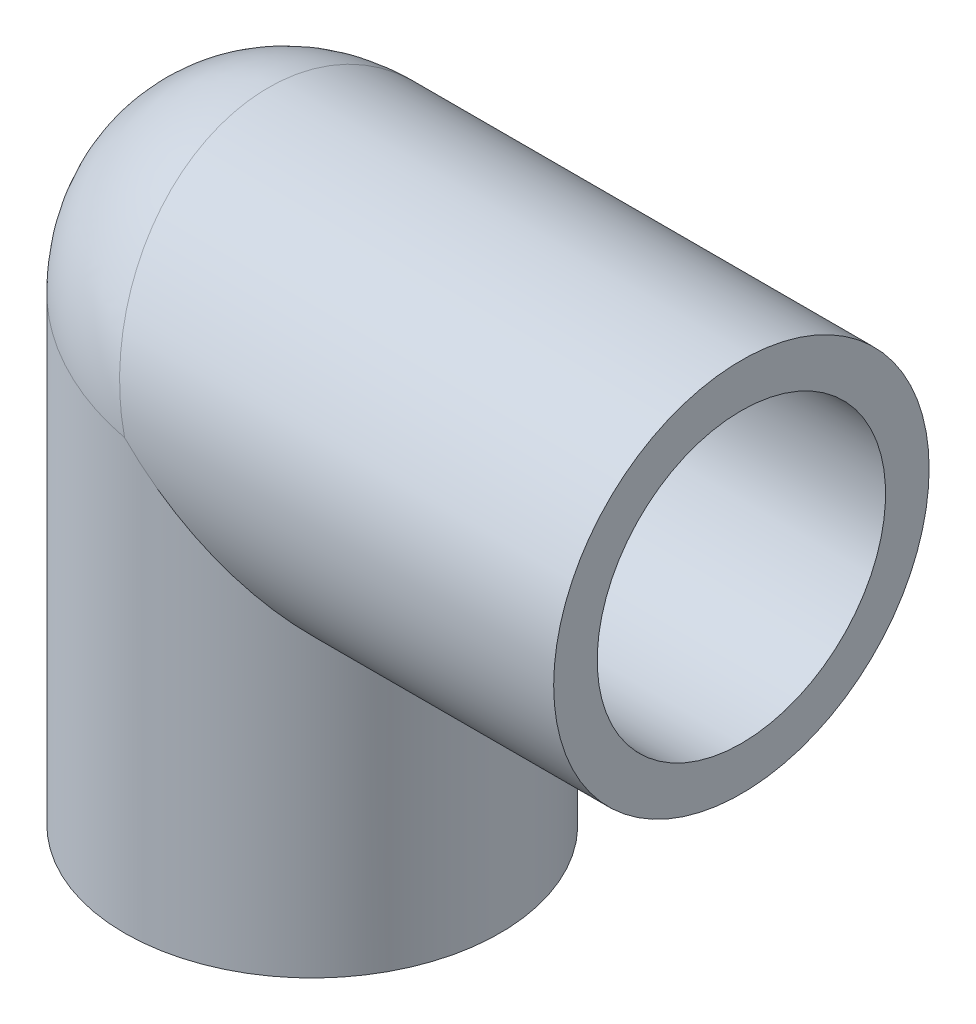
ISO-10303-21;
HEADER;
FILE_DESCRIPTION(('STEP AP214'),'2;1');
FILE_NAME('part.step','',(''),(''),'','','');
FILE_SCHEMA(('AUTOMOTIVE_DESIGN { 1 0 10303 214 1 1 1 1 }'));
ENDSEC;
DATA;
#1=APPLICATION_CONTEXT('core data for automotive mechanical design processes');
#2=APPLICATION_PROTOCOL_DEFINITION('international standard','automotive_design',2000,#1);
#3=PRODUCT_CONTEXT('',#1,'mechanical');
#4=PRODUCT('Part','Part','',(#3));
#5=PRODUCT_RELATED_PRODUCT_CATEGORY('part','',(#4));
#6=PRODUCT_DEFINITION_FORMATION('','',#4);
#7=PRODUCT_DEFINITION_CONTEXT('part definition',#1,'design');
#8=PRODUCT_DEFINITION('design','',#6,#7);
#9=PRODUCT_DEFINITION_SHAPE('','',#8);
#10=(LENGTH_UNIT() NAMED_UNIT(*) SI_UNIT(.MILLI.,.METRE.));
#11=(NAMED_UNIT(*) PLANE_ANGLE_UNIT() SI_UNIT($,.RADIAN.));
#12=(NAMED_UNIT(*) SI_UNIT($,.STERADIAN.) SOLID_ANGLE_UNIT());
#13=UNCERTAINTY_MEASURE_WITH_UNIT(LENGTH_MEASURE(1.E-05),#10,'distance_accuracy_value','');
#14=(GEOMETRIC_REPRESENTATION_CONTEXT(3) GLOBAL_UNCERTAINTY_ASSIGNED_CONTEXT((#13)) GLOBAL_UNIT_ASSIGNED_CONTEXT((#10,
#11,#12)) REPRESENTATION_CONTEXT('',''));
#15=CARTESIAN_POINT('',(0.,0.,0.));
#16=DIRECTION('',(0.,0.,1.));
#17=DIRECTION('',(1.,0.,0.));
#18=AXIS2_PLACEMENT_3D('',#15,#16,#17);
#19=CARTESIAN_POINT('',(0.,-12.7,0.));
#20=DIRECTION('',(0.,-1.,0.));
#21=DIRECTION('',(0.,0.,-1.));
#22=AXIS2_PLACEMENT_3D('',#19,#20,#21);
#23=PLANE('',#22);
#24=CARTESIAN_POINT('',(0.,-12.7,0.));
#25=DIRECTION('',(0.,-1.,0.));
#26=DIRECTION('',(0.,0.,-1.));
#27=AXIS2_PLACEMENT_3D('',#24,#25,#26);
#28=CIRCLE('',#27,10.668);
#29=CARTESIAN_POINT('',(0.,-12.7,-10.668));
#30=VERTEX_POINT('',#29);
#31=EDGE_CURVE('E76',#30,#30,#28,.T.);
#32=ORIENTED_EDGE('',*,*,#31,.T.);
#33=EDGE_LOOP('',(#32));
#34=FACE_BOUND('',#33,.T.);
#35=CARTESIAN_POINT('',(0.,-12.7,0.));
#36=DIRECTION('',(0.,1.,0.));
#37=DIRECTION('',(0.,0.,1.));
#38=AXIS2_PLACEMENT_3D('',#35,#36,#37);
#39=CIRCLE('',#38,6.9342);
#40=CARTESIAN_POINT('',(-6.9342,-12.7,0.));
#41=VERTEX_POINT('',#40);
#42=EDGE_CURVE('E93',#41,#41,#39,.T.);
#43=ORIENTED_EDGE('',*,*,#42,.T.);
#44=EDGE_LOOP('',(#43));
#45=FACE_BOUND('',#44,.T.);
#46=ADVANCED_FACE('F43',(#34,#45),#23,.T.);
#47=CARTESIAN_POINT('',(12.7,0.,0.));
#48=DIRECTION('',(1.,0.,0.));
#49=DIRECTION('',(0.,1.,0.));
#50=AXIS2_PLACEMENT_3D('',#47,#48,#49);
#51=PLANE('',#50);
#52=CARTESIAN_POINT('',(12.7,0.,0.));
#53=DIRECTION('',(1.,0.,0.));
#54=DIRECTION('',(0.,1.,0.));
#55=AXIS2_PLACEMENT_3D('',#52,#53,#54);
#56=CIRCLE('',#55,10.668);
#57=CARTESIAN_POINT('',(12.7,10.668,0.));
#58=VERTEX_POINT('',#57);
#59=EDGE_CURVE('E82',#58,#58,#56,.T.);
#60=ORIENTED_EDGE('',*,*,#59,.T.);
#61=EDGE_LOOP('',(#60));
#62=FACE_BOUND('',#61,.T.);
#63=CARTESIAN_POINT('',(12.7,0.,0.));
#64=DIRECTION('',(1.,0.,0.));
#65=DIRECTION('',(0.,0.,1.));
#66=AXIS2_PLACEMENT_3D('',#63,#64,#65);
#67=CIRCLE('',#66,6.9342);
#68=CARTESIAN_POINT('',(12.7,6.93419999999999,0.));
#69=VERTEX_POINT('',#68);
#70=EDGE_CURVE('E88',#69,#69,#67,.T.);
#71=ORIENTED_EDGE('',*,*,#70,.F.);
#72=EDGE_LOOP('',(#71));
#73=FACE_BOUND('',#72,.T.);
#74=ADVANCED_FACE('F112',(#62,#73),#51,.T.);
#75=CARTESIAN_POINT('',(0.,0.,-13.890625));
#76=CARTESIAN_POINT('',(0.,0.,-13.890625));
#77=CARTESIAN_POINT('',(0.,0.,-13.890625));
#78=CARTESIAN_POINT('',(-0.326030417014347,0.0756390567307606,-13.8906027574469));
#79=CARTESIAN_POINT('',(-0.200837417123203,0.200837417123202,-13.8905885661179));
#80=CARTESIAN_POINT('',(-0.0756390567307606,0.326030417014347,-13.8906027574469));
#81=CARTESIAN_POINT('',(-0.6520573367005,0.15127730210429,-13.8791450873196));
#82=CARTESIAN_POINT('',(-0.401833804761431,0.401833804761431,-13.8879604827564));
#83=CARTESIAN_POINT('',(-0.15127730210429,0.6520573367005,-13.8791450873196));
#84=CARTESIAN_POINT('',(-1.30330403167624,0.30236653535915,-13.8332061930762));
#85=CARTESIAN_POINT('',(-0.804866601879955,0.804866601879956,-13.8772303622792));
#86=CARTESIAN_POINT('',(-0.30236653535915,1.30330403167624,-13.8332061930762));
#87=CARTESIAN_POINT('',(-1.62852379170069,0.377817519698968,-13.7987245368072));
#88=CARTESIAN_POINT('',(-1.00723840387897,1.00723840387897,-13.8691102658237));
#89=CARTESIAN_POINT('',(-0.377817519698968,1.62852379170069,-13.7987245368072));
#90=CARTESIAN_POINT('',(-2.27790946913727,0.528474996862335,-13.7065046179071));
#91=CARTESIAN_POINT('',(-1.41477886770129,1.41477886770129,-13.847002608813));
#92=CARTESIAN_POINT('',(-0.528474996862335,2.27790946913727,-13.7065046179071));
#93=CARTESIAN_POINT('',(-2.60207255961244,0.603680833836455,-13.648725902029));
#94=CARTESIAN_POINT('',(-1.62029821331791,1.62029821331791,-13.8329669339002));
#95=CARTESIAN_POINT('',(-0.603680833836455,2.60207255961244,-13.648725902029));
#96=CARTESIAN_POINT('',(-3.24781115447715,0.753492187832481,-13.5096376734908));
#97=CARTESIAN_POINT('',(-2.03519864516539,2.03519864516539,-13.7982019625138));
#98=CARTESIAN_POINT('',(-0.753492187832481,3.24781115447715,-13.5096376734908));
#99=CARTESIAN_POINT('',(-3.56938645993629,0.828097658702539,-13.4283263692425));
#100=CARTESIAN_POINT('',(-2.24494413307651,2.24494413307651,-13.7774095882762));
#101=CARTESIAN_POINT('',(-0.828097658702539,3.56938645993629,-13.4283263692425));
#102=CARTESIAN_POINT('',(-4.66065831107523,1.08127272817592,-13.1100510969373));
#103=CARTESIAN_POINT('',(-2.97330543159556,2.97330543159556,-13.6929261775302));
#104=CARTESIAN_POINT('',(-1.08127272817592,4.66065831107523,-13.1100510969373));
#105=CARTESIAN_POINT('',(-5.4227228784835,1.25807170781613,-12.8152974170361));
#106=CARTESIAN_POINT('',(-3.50601760177652,3.50601760177652,-13.6100702976292));
#107=CARTESIAN_POINT('',(-1.25807170781613,5.4227228784835,-12.8152974170361));
#108=CARTESIAN_POINT('',(-6.53838795154788,1.51690600476394,-12.2626064585577));
#109=CARTESIAN_POINT('',(-4.33857925975706,4.33857925975706,-13.4313993181265));
#110=CARTESIAN_POINT('',(-1.51690600476394,6.53838795154788,-12.2626064585577));
#111=CARTESIAN_POINT('',(-6.90606351946638,1.60220673651909,-12.059687126308));
#112=CARTESIAN_POINT('',(-4.62596125358252,4.62596125358252,-13.3615246248215));
#113=CARTESIAN_POINT('',(-1.60220673651909,6.90606351946638,-12.059687126308));
#114=CARTESIAN_POINT('',(-7.62976974409105,1.77010658062858,-11.6153504215895));
#115=CARTESIAN_POINT('',(-5.2179989156884,5.2179989156884,-13.1957575296165));
#116=CARTESIAN_POINT('',(-1.77010658062858,7.62976974409105,-11.6153504215895));
#117=CARTESIAN_POINT('',(-7.98579951227385,1.85270548684549,-11.3739301198837));
#118=CARTESIAN_POINT('',(-5.52360240194462,5.52360240194462,-13.0992580138327));
#119=CARTESIAN_POINT('',(-1.85270548684549,7.98579951227385,-11.3739301198837));
#120=CARTESIAN_POINT('',(-8.71143735468956,2.02105346629019,-10.829704852145));
#121=CARTESIAN_POINT('',(-6.18150635776142,6.18150635776142,-12.8609211236877));
#122=CARTESIAN_POINT('',(-2.02105346629019,8.71143735468956,-10.829704852145));
#123=CARTESIAN_POINT('',(-9.07977726132714,2.10650832463645,-10.5234956939638));
#124=CARTESIAN_POINT('',(-6.5363137067397,6.5363137067397,-12.7151076624425));
#125=CARTESIAN_POINT('',(-2.10650832463645,9.07977726132714,-10.5234956939638));
#126=CARTESIAN_POINT('',(-9.79403741645333,2.2722166806238,-9.86220937286497));
#127=CARTESIAN_POINT('',(-7.27263098475856,7.27263098475856,-12.3635839633349));
#128=CARTESIAN_POINT('',(-2.2722166806238,9.79403741645333,-9.86220937286497));
#129=CARTESIAN_POINT('',(-10.1399556692208,2.35246971525758,-9.50712786864768));
#130=CARTESIAN_POINT('',(-7.65549405557506,7.65549405557506,-12.1561272912209));
#131=CARTESIAN_POINT('',(-2.35246971525758,10.1399556692208,-9.50712786864768));
#132=CARTESIAN_POINT('',(-10.8032608649189,2.50635652066285,-8.74607822610643));
#133=CARTESIAN_POINT('',(-8.44782005029985,8.44782005029985,-11.655380835131));
#134=CARTESIAN_POINT('',(-2.50635652066285,10.8032608649189,-8.74607822610643));
#135=CARTESIAN_POINT('',(-11.1206265820953,2.57998536705934,-8.3400727593629));
#136=CARTESIAN_POINT('',(-8.8584543721076,8.8584543721076,-11.3595163596562));
#137=CARTESIAN_POINT('',(-2.57998536705934,11.1206265820953,-8.3400727593629));
#138=CARTESIAN_POINT('',(-11.718542076382,2.71870176173392,-7.47669766154073));
#139=CARTESIAN_POINT('',(-9.69815472547955,9.69815472547955,-10.6478962103039));
#140=CARTESIAN_POINT('',(-2.71870176173392,11.718542076382,-7.47669766154073));
#141=CARTESIAN_POINT('',(-11.9990935358004,2.78378970030747,-7.01933037932631));
#142=CARTESIAN_POINT('',(-10.1276900364874,10.1276900364874,-10.2288847490119));
#143=CARTESIAN_POINT('',(-2.78378970030747,11.9990935358004,-7.01933037932631));
#144=CARTESIAN_POINT('',(-12.5081450412848,2.90188964957634,-6.06475468995571));
#145=CARTESIAN_POINT('',(-10.9738285988214,10.9738285988214,-9.24223000053762));
#146=CARTESIAN_POINT('',(-2.90188964957634,12.5081450412848,-6.06475468995571));
#147=CARTESIAN_POINT('',(-12.7376494253004,2.95513466667554,-5.56863660692953));
#148=CARTESIAN_POINT('',(-11.3898219207653,11.3898219207653,-8.67458221846813));
#149=CARTESIAN_POINT('',(-2.95513466667554,12.7376494253004,-5.56863660692953));
#150=CARTESIAN_POINT('',(-13.0406465082234,3.02542998991136,-4.79253583631219));
#151=CARTESIAN_POINT('',(-11.9771103409353,11.9771103409353,-7.69348308775306));
#152=CARTESIAN_POINT('',(-3.02542998991136,13.0406465082234,-4.79253583631219));
#153=CARTESIAN_POINT('',(-13.134792031147,3.04727175122655,-4.52842701694025));
#154=CARTESIAN_POINT('',(-12.1680217628525,12.1680217628525,-7.34150687138118));
#155=CARTESIAN_POINT('',(-3.04727175122655,13.134792031147,-4.52842701694025));
#156=CARTESIAN_POINT('',(-13.308060941261,3.0874701383751,-3.99057400002489));
#157=CARTESIAN_POINT('',(-12.5313283995191,12.5313283995191,-6.59134971428804));
#158=CARTESIAN_POINT('',(-3.0874701383751,13.308060941261,-3.99057400002489));
#159=CARTESIAN_POINT('',(-13.3871902620272,3.10582814079799,-3.71683365922674));
#160=CARTESIAN_POINT('',(-12.7032566216899,12.7032566216899,-6.193241095436));
#161=CARTESIAN_POINT('',(-3.10582814079799,13.3871902620272,-3.71683365922674));
#162=CARTESIAN_POINT('',(-13.5285301686024,3.13861899910816,-3.16370792761921));
#163=CARTESIAN_POINT('',(-13.0192435424046,13.0192435424046,-5.35686924014419));
#164=CARTESIAN_POINT('',(-3.13861899910816,13.5285301686024,-3.16370792761921));
#165=CARTESIAN_POINT('',(-13.5908958439277,3.15308783576342,-2.88440193045737));
#166=CARTESIAN_POINT('',(-13.1630354974808,13.1630354974808,-4.91935246256048));
#167=CARTESIAN_POINT('',(-3.15308783576342,13.5908958439277,-2.88440193045737));
#168=CARTESIAN_POINT('',(-13.6986300126048,3.17808216295476,-2.319407262799));
#169=CARTESIAN_POINT('',(-13.416997487898,13.416997487898,-4.00668218070787));
#170=CARTESIAN_POINT('',(-3.17808216295476,13.6986300126048,-2.319407262799));
#171=CARTESIAN_POINT('',(-13.7440056477426,3.18860931038514,-2.03372132775094));
#172=CARTESIAN_POINT('',(-13.5266583968378,13.5266583968378,-3.53225160330357));
#173=CARTESIAN_POINT('',(-3.18860931038514,13.7440056477426,-2.03372132775094));
#174=CARTESIAN_POINT('',(-13.8169581308596,3.20553428646647,-1.45785813713249));
#175=CARTESIAN_POINT('',(-13.7056176229592,13.7056176229592,-2.55495819376742));
#176=CARTESIAN_POINT('',(-3.20553428646647,13.8169581308596,-1.45785813713249));
#177=CARTESIAN_POINT('',(-13.8445370703939,3.21193260035822,-1.16768141344767));
#178=CARTESIAN_POINT('',(-13.7744948732015,13.7744948732015,-2.05314213648455));
#179=CARTESIAN_POINT('',(-3.21193260035822,13.8445370703939,-1.16768141344767));
#180=CARTESIAN_POINT('',(-13.8813704619392,3.22047794714321,-0.5850031192261));
#181=CARTESIAN_POINT('',(-13.8671185317741,13.8671185317741,-1.03358773642515));
#182=CARTESIAN_POINT('',(-3.22047794714321,13.8813704619392,-0.5850031192261));
#183=CARTESIAN_POINT('',(-13.890625,3.222625,-0.292501559613043));
#184=CARTESIAN_POINT('',(-13.890625,13.890625,-0.517138867588101));
#185=CARTESIAN_POINT('',(-3.222625,13.890625,-0.292501559613043));
#186=CARTESIAN_POINT('',(-13.890625,3.222625,0.292501559613071));
#187=CARTESIAN_POINT('',(-13.890625,13.890625,0.517138867588151));
#188=CARTESIAN_POINT('',(-3.222625,13.890625,0.292501559613071));
#189=CARTESIAN_POINT('',(-13.8813704619392,3.22047794714321,0.585003119226126));
#190=CARTESIAN_POINT('',(-13.8671185317741,13.8671185317741,1.03358773642519));
#191=CARTESIAN_POINT('',(-3.22047794714321,13.8813704619392,0.585003119226126));
#192=CARTESIAN_POINT('',(-13.8445370703939,3.21193260035822,1.1676814134477));
#193=CARTESIAN_POINT('',(-13.7744948732015,13.7744948732015,2.05314213648459));
#194=CARTESIAN_POINT('',(-3.21193260035822,13.8445370703939,1.1676814134477));
#195=CARTESIAN_POINT('',(-13.8169581308596,3.20553428646647,1.45785813713251));
#196=CARTESIAN_POINT('',(-13.7056176229592,13.7056176229592,2.55495819376747));
#197=CARTESIAN_POINT('',(-3.20553428646647,13.8169581308596,1.45785813713251));
#198=CARTESIAN_POINT('',(-13.7440056477426,3.18860931038514,2.03372132775097));
#199=CARTESIAN_POINT('',(-13.5266583968378,13.5266583968378,3.53225160330361));
#200=CARTESIAN_POINT('',(-3.18860931038514,13.7440056477426,2.03372132775097));
#201=CARTESIAN_POINT('',(-13.6986300126048,3.17808216295476,2.31940726279903));
#202=CARTESIAN_POINT('',(-13.416997487898,13.416997487898,4.00668218070791));
#203=CARTESIAN_POINT('',(-3.17808216295476,13.6986300126048,2.31940726279903));
#204=CARTESIAN_POINT('',(-13.5908958439277,3.15308783576341,2.8844019304574));
#205=CARTESIAN_POINT('',(-13.1630354974808,13.1630354974808,4.91935246256053));
#206=CARTESIAN_POINT('',(-3.15308783576341,13.5908958439277,2.8844019304574));
#207=CARTESIAN_POINT('',(-13.5285301686024,3.13861899910815,3.16370792761924));
#208=CARTESIAN_POINT('',(-13.0192435424046,13.0192435424046,5.35686924014423));
#209=CARTESIAN_POINT('',(-3.13861899910815,13.5285301686024,3.16370792761924));
#210=CARTESIAN_POINT('',(-13.3871902620272,3.10582814079799,3.71683365922677));
#211=CARTESIAN_POINT('',(-12.7032566216899,12.7032566216899,6.19324109543605));
#212=CARTESIAN_POINT('',(-3.10582814079799,13.3871902620272,3.71683365922677));
#213=CARTESIAN_POINT('',(-13.308060941261,3.08747013837509,3.99057400002491));
#214=CARTESIAN_POINT('',(-12.5313283995191,12.5313283995191,6.59134971428807));
#215=CARTESIAN_POINT('',(-3.08747013837509,13.308060941261,3.99057400002491));
#216=CARTESIAN_POINT('',(-13.134792031147,3.04727175122655,4.52842701694028));
#217=CARTESIAN_POINT('',(-12.1680217628525,12.1680217628525,7.34150687138122));
#218=CARTESIAN_POINT('',(-3.04727175122655,13.134792031147,4.52842701694028));
#219=CARTESIAN_POINT('',(-13.0406465082234,3.02542998991135,4.79253583631222));
#220=CARTESIAN_POINT('',(-11.9771103409352,11.9771103409352,7.69348308775309));
#221=CARTESIAN_POINT('',(-3.02542998991135,13.0406465082234,4.79253583631222));
#222=CARTESIAN_POINT('',(-12.7376494253004,2.95513466667554,5.56863660692956));
#223=CARTESIAN_POINT('',(-11.3898219207653,11.3898219207653,8.67458221846817));
#224=CARTESIAN_POINT('',(-2.95513466667554,12.7376494253004,5.56863660692956));
#225=CARTESIAN_POINT('',(-12.5081450412848,2.90188964957634,6.06475468995574));
#226=CARTESIAN_POINT('',(-10.9738285988213,10.9738285988213,9.24223000053765));
#227=CARTESIAN_POINT('',(-2.90188964957634,12.5081450412848,6.06475468995574));
#228=CARTESIAN_POINT('',(-11.9990935358004,2.78378970030746,7.01933037932633));
#229=CARTESIAN_POINT('',(-10.1276900364874,10.1276900364874,10.2288847490119));
#230=CARTESIAN_POINT('',(-2.78378970030746,11.9990935358004,7.01933037932633));
#231=CARTESIAN_POINT('',(-11.718542076382,2.71870176173392,7.47669766154075));
#232=CARTESIAN_POINT('',(-9.69815472547954,9.69815472547954,10.647896210304));
#233=CARTESIAN_POINT('',(-2.71870176173392,11.718542076382,7.47669766154075));
#234=CARTESIAN_POINT('',(-11.1206265820952,2.57998536705933,8.34007275936292));
#235=CARTESIAN_POINT('',(-8.85845437210758,8.85845437210758,11.3595163596562));
#236=CARTESIAN_POINT('',(-2.57998536705933,11.1206265820952,8.34007275936292));
#237=CARTESIAN_POINT('',(-10.8032608649189,2.50635652066284,8.74607822610645));
#238=CARTESIAN_POINT('',(-8.44782005029982,8.44782005029982,11.655380835131));
#239=CARTESIAN_POINT('',(-2.50635652066284,10.8032608649189,8.74607822610645));
#240=CARTESIAN_POINT('',(-10.1399556692208,2.35246971525757,9.5071278686477));
#241=CARTESIAN_POINT('',(-7.65549405557504,7.65549405557504,12.1561272912209));
#242=CARTESIAN_POINT('',(-2.35246971525757,10.1399556692208,9.5071278686477));
#243=CARTESIAN_POINT('',(-9.79403741645331,2.27221668062379,9.862209372865));
#244=CARTESIAN_POINT('',(-7.27263098475854,7.27263098475854,12.3635839633349));
#245=CARTESIAN_POINT('',(-2.27221668062379,9.79403741645331,9.862209372865));
#246=CARTESIAN_POINT('',(-9.07977726132712,2.10650832463644,10.5234956939638));
#247=CARTESIAN_POINT('',(-6.53631370673968,6.53631370673968,12.7151076624425));
#248=CARTESIAN_POINT('',(-2.10650832463644,9.07977726132712,10.5234956939638));
#249=CARTESIAN_POINT('',(-8.71143735468954,2.02105346629018,10.829704852145));
#250=CARTESIAN_POINT('',(-6.1815063577614,6.1815063577614,12.8609211236877));
#251=CARTESIAN_POINT('',(-2.02105346629018,8.71143735468954,10.829704852145));
#252=CARTESIAN_POINT('',(-7.98579951227383,1.85270548684549,11.3739301198837));
#253=CARTESIAN_POINT('',(-5.5236024019446,5.5236024019446,13.0992580138327));
#254=CARTESIAN_POINT('',(-1.85270548684549,7.98579951227383,11.3739301198837));
#255=CARTESIAN_POINT('',(-7.62976974409103,1.77010658062857,11.6153504215895));
#256=CARTESIAN_POINT('',(-5.21799891568838,5.21799891568838,13.1957575296165));
#257=CARTESIAN_POINT('',(-1.77010658062857,7.62976974409103,11.6153504215895));
#258=CARTESIAN_POINT('',(-6.90606351946636,1.60220673651909,12.059687126308));
#259=CARTESIAN_POINT('',(-4.6259612535825,4.6259612535825,13.3615246248215));
#260=CARTESIAN_POINT('',(-1.60220673651909,6.90606351946636,12.059687126308));
#261=CARTESIAN_POINT('',(-6.53838795154786,1.51690600476393,12.2626064585577));
#262=CARTESIAN_POINT('',(-4.33857925975704,4.33857925975704,13.4313993181266));
#263=CARTESIAN_POINT('',(-1.51690600476393,6.53838795154786,12.2626064585577));
#264=CARTESIAN_POINT('',(-5.42272287848348,1.25807170781612,12.8152974170361));
#265=CARTESIAN_POINT('',(-3.5060176017765,3.5060176017765,13.6100702976292));
#266=CARTESIAN_POINT('',(-1.25807170781612,5.42272287848348,12.8152974170361));
#267=CARTESIAN_POINT('',(-4.6606583110752,1.08127272817591,13.1100510969373));
#268=CARTESIAN_POINT('',(-2.97330543159554,2.97330543159554,13.6929261775302));
#269=CARTESIAN_POINT('',(-1.08127272817591,4.6606583110752,13.1100510969373));
#270=CARTESIAN_POINT('',(-3.56938645993627,0.828097658702533,13.4283263692425));
#271=CARTESIAN_POINT('',(-2.2449441330765,2.2449441330765,13.7774095882762));
#272=CARTESIAN_POINT('',(-0.828097658702533,3.56938645993627,13.4283263692425));
#273=CARTESIAN_POINT('',(-3.24781115447713,0.753492187832476,13.5096376734908));
#274=CARTESIAN_POINT('',(-2.03519864516537,2.03519864516537,13.7982019625138));
#275=CARTESIAN_POINT('',(-0.753492187832476,3.24781115447713,13.5096376734908));
#276=CARTESIAN_POINT('',(-2.60207255961242,0.603680833836449,13.648725902029));
#277=CARTESIAN_POINT('',(-1.6202982133179,1.6202982133179,13.8329669339002));
#278=CARTESIAN_POINT('',(-0.603680833836449,2.60207255961242,13.648725902029));
#279=CARTESIAN_POINT('',(-2.27790946913725,0.528474996862329,13.7065046179071));
#280=CARTESIAN_POINT('',(-1.41477886770128,1.41477886770128,13.847002608813));
#281=CARTESIAN_POINT('',(-0.528474996862329,2.27790946913725,13.7065046179071));
#282=CARTESIAN_POINT('',(-1.62852379170066,0.377817519698962,13.7987245368072));
#283=CARTESIAN_POINT('',(-1.00723840387895,1.00723840387895,13.8691102658237));
#284=CARTESIAN_POINT('',(-0.377817519698962,1.62852379170066,13.7987245368072));
#285=CARTESIAN_POINT('',(-1.30330403167621,0.302366535359143,13.8332061930762));
#286=CARTESIAN_POINT('',(-0.80486660187994,0.804866601879939,13.8772303622792));
#287=CARTESIAN_POINT('',(-0.302366535359143,1.30330403167621,13.8332061930762));
#288=CARTESIAN_POINT('',(-0.652057336700474,0.151277302104284,13.8791450873196));
#289=CARTESIAN_POINT('',(-0.401833804761414,0.401833804761416,13.8879604827564));
#290=CARTESIAN_POINT('',(-0.151277302104284,0.652057336700474,13.8791450873196));
#291=CARTESIAN_POINT('',(-0.326030417014322,0.0756390567307546,13.8906027574469));
#292=CARTESIAN_POINT('',(-0.200837417123184,0.20083741712319,13.8905885661179));
#293=CARTESIAN_POINT('',(-0.0756390567307546,0.326030417014322,13.8906027574469));
#294=CARTESIAN_POINT('',(0.,0.,13.890625));
#295=CARTESIAN_POINT('',(0.,0.,13.890625));
#296=CARTESIAN_POINT('',(0.,0.,13.890625));
#297=(BOUNDED_SURFACE() B_SPLINE_SURFACE(3,2,((#75,#76,#77),(#78,#79,#80),(#81,#82,#83),(#84,
#85,#86),(#87,#88,#89),(#90,#91,#92),(#93,#94,#95),(#96,#97,#98),(#99,#100,#101),(#102,#103,
#104),(#105,#106,#107),(#108,#109,#110),(#111,#112,#113),(#114,#115,#116),(#117,#118,#119),
(#120,#121,#122),(#123,#124,#125),(#126,#127,#128),(#129,#130,#131),(#132,#133,#134),(#135,#136,
#137),(#138,#139,#140),(#141,#142,#143),(#144,#145,#146),(#147,#148,#149),(#150,#151,#152),
(#153,#154,#155),(#156,#157,#158),(#159,#160,#161),(#162,#163,#164),(#165,#166,#167),(#168,#169,
#170),(#171,#172,#173),(#174,#175,#176),(#177,#178,#179),(#180,#181,#182),(#183,#184,#185),
(#186,#187,#188),(#189,#190,#191),(#192,#193,#194),(#195,#196,#197),(#198,#199,#200),(#201,#202,
#203),(#204,#205,#206),(#207,#208,#209),(#210,#211,#212),(#213,#214,#215),(#216,#217,#218),
(#219,#220,#221),(#222,#223,#224),(#225,#226,#227),(#228,#229,#230),(#231,#232,#233),(#234,#235,
#236),(#237,#238,#239),(#240,#241,#242),(#243,#244,#245),(#246,#247,#248),(#249,#250,#251),
(#252,#253,#254),(#255,#256,#257),(#258,#259,#260),(#261,#262,#263),(#264,#265,#266),(#267,#268,
#269),(#270,#271,#272),(#273,#274,#275),(#276,#277,#278),(#279,#280,#281),(#282,#283,#284),
(#285,#286,#287),(#288,#289,#290),(#291,#292,#293),(#294,#295,#296)),.UNSPECIFIED.,.F.,.F.,
.F.) B_SPLINE_SURFACE_WITH_KNOTS((4,2,2,2,2,2,2,2,2,2,2,2,2,2,2,2,2,2,2,2,2,2,2,2,2,2,2,2,2,2,2,
2,2,2,2,2,4),(3,3),(0.,0.320873180031749,0.641752382922128,0.963191179762626,1.28465445489232,
2.05949238871881,2.44770013551923,2.83593743210659,3.2559029041037,3.67590570547424,
4.0962181976818,4.51651147609741,4.92761124542621,5.13329034649451,5.33888800450873,
5.54251242941621,5.74605116417841,5.9495659737104,6.15307982755259,6.35659368139478,
6.56010849092677,6.76364722568897,6.96727165059645,7.17286930861068,7.37854840967897,
7.78964817900777,8.20994145742339,8.63025394963094,9.05025675100149,9.4702222229986,
9.85845951958595,10.2466672663864,11.0215052002129,11.3429684753426,11.6644072721831,
11.9852864750734,12.3061596551052),(0.,1.),
.UNSPECIFIED.) GEOMETRIC_REPRESENTATION_ITEM() RATIONAL_B_SPLINE_SURFACE(((1.,1.,1.),(1.,
1.00000025278363,1.),(1.,0.999586781925967,1.),(1.,0.997934713731738,1.),(1.,0.996696100907512,
1.),(1.,0.993393192221924,1.),(1.,0.991327460186237,1.),(1.,0.986378528512737,1.),(1.,
0.983495266634902,1.),(1.,0.972271112377858,1.),(1.,0.961968100977126,1.),(1.,0.943196224731558,
1.),(1.,0.936377428887728,1.),(1.,0.921705466862956,1.),(1.,0.913852221986816,1.),(1.,
0.896545378925256,1.),(1.,0.887013443919078,1.),(1.,0.867097802711766,1.),(1.,0.856714020874753,
1.),(1.,0.835440076293616,1.),(1.,0.824549545812965,1.),(1.,0.802803872267079,1.),(1.,
0.791948727606934,1.),(1.,0.771260076687125,1.),(1.,0.761409416972419,1.),(1.,0.74790780472794,
1.),(1.,0.743618516944411,1.),(1.,0.735591805422616,1.),(1.,0.73185416383447,1.),(1.,
0.725087630246837,1.),(1.,0.722052280275145,1.),(1.,0.716757247371341,1.),(1.,0.71449723855708,
1.),(1.,0.710841845033041,1.),(1.,0.709446358721104,1.),(1.,0.70757882896605,1.),(1.,
0.707106781186548,1.),(1.,0.707106781186548,1.),(1.,0.70757882896605,1.),(1.,0.709446358721104,
1.),(1.,0.710841845033041,1.),(1.,0.71449723855708,1.),(1.,0.716757247371341,1.),(1.,
0.722052280275146,1.),(1.,0.725087630246838,1.),(1.,0.73185416383447,1.),(1.,0.735591805422616,
1.),(1.,0.743618516944411,1.),(1.,0.74790780472794,1.),(1.,0.761409416972419,1.),(1.,
0.771260076687126,1.),(1.,0.791948727606934,1.),(1.,0.80280387226708,1.),(1.,0.824549545812965,
1.),(1.,0.835440076293616,1.),(1.,0.856714020874754,1.),(1.,0.867097802711766,1.),(1.,
0.887013443919079,1.),(1.,0.896545378925256,1.),(1.,0.913852221986816,1.),(1.,0.921705466862956,
1.),(1.,0.936377428887728,1.),(1.,0.943196224731558,1.),(1.,0.961968100977126,1.),(1.,
0.972271112377858,1.),(1.,0.983495266634902,1.),(1.,0.986378528512737,1.),(1.,0.991327460186237,
1.),(1.,0.993393192221924,1.),(1.,0.996696100907512,1.),(1.,0.997934713731738,1.),(1.,
0.999586781925967,1.),(1.,1.00000025278363,1.),(1.,1.,1.))) REPRESENTATION_ITEM('') SURFACE());
#298=CARTESIAN_POINT('',(0.,0.,0.));
#299=DIRECTION('',(-0.974127844635725,-0.225997659955488,0.));
#300=DIRECTION('',(0.225997659955488,-0.974127844635725,0.));
#301=AXIS2_PLACEMENT_3D('',#298,#299,#300);
#302=ELLIPSE('',#301,14.2595503008072,13.890625);
#303=CARTESIAN_POINT('',(0.,0.,-13.890625));
#304=VERTEX_POINT('',#303);
#305=CARTESIAN_POINT('',(0.,0.,13.890625));
#306=VERTEX_POINT('',#305);
#307=EDGE_CURVE('E54',#304,#306,#302,.F.);
#308=ORIENTED_EDGE('',*,*,#307,.F.);
#309=CARTESIAN_POINT('',(0.,0.,0.));
#310=DIRECTION('',(-0.225997659955488,-0.974127844635725,0.));
#311=DIRECTION('',(0.974127844635725,-0.225997659955488,0.));
#312=AXIS2_PLACEMENT_3D('',#309,#310,#311);
#313=ELLIPSE('',#312,14.2595503008072,13.890625);
#314=EDGE_CURVE('E12',#306,#304,#313,.T.);
#315=ORIENTED_EDGE('',*,*,#314,.F.);
#316=EDGE_LOOP('',(#308,#315));
#317=FACE_BOUND('',#316,.T.);
#318=ADVANCED_FACE('F65',(#317),#297,.T.);
#319=CARTESIAN_POINT('',(0.,0.,0.));
#320=DIRECTION('',(1.,0.,0.));
#321=DIRECTION('',(0.,0.,-1.));
#322=AXIS2_PLACEMENT_3D('',#319,#320,#321);
#323=CYLINDRICAL_SURFACE('',#322,13.890625);
#324=CARTESIAN_POINT('',(0.,0.,0.));
#325=DIRECTION('',(0.707106781186548,0.707106781186548,0.));
#326=DIRECTION('',(0.707106781186548,-0.707106781186548,0.));
#327=AXIS2_PLACEMENT_3D('',#324,#325,#326);
#328=ELLIPSE('',#327,19.6443102648388,13.890625);
#329=EDGE_CURVE('E64',#306,#304,#328,.T.);
#330=ORIENTED_EDGE('',*,*,#329,.T.);
#331=ORIENTED_EDGE('',*,*,#307,.T.);
#332=EDGE_LOOP('',(#330,#331));
#333=FACE_BOUND('',#332,.T.);
#334=CARTESIAN_POINT('',(31.75,0.,0.));
#335=DIRECTION('',(1.,0.,0.));
#336=DIRECTION('',(0.,0.,-1.));
#337=AXIS2_PLACEMENT_3D('',#334,#335,#336);
#338=CIRCLE('',#337,13.890625);
#339=CARTESIAN_POINT('',(31.75,0.,-13.890625));
#340=VERTEX_POINT('',#339);
#341=EDGE_CURVE('E67',#340,#340,#338,.F.);
#342=ORIENTED_EDGE('',*,*,#341,.T.);
#343=EDGE_LOOP('',(#342));
#344=FACE_BOUND('',#343,.T.);
#345=ADVANCED_FACE('F69',(#333,#344),#323,.T.);
#346=CARTESIAN_POINT('',(0.,39.2886205296776,0.));
#347=DIRECTION('',(0.,-1.,0.));
#348=DIRECTION('',(0.,0.,-1.));
#349=AXIS2_PLACEMENT_3D('',#346,#347,#348);
#350=CYLINDRICAL_SURFACE('',#349,13.890625);
#351=CARTESIAN_POINT('',(0.,-31.75,0.));
#352=DIRECTION('',(0.,1.,0.));
#353=DIRECTION('',(0.,0.,1.));
#354=AXIS2_PLACEMENT_3D('',#351,#352,#353);
#355=CIRCLE('',#354,13.890625);
#356=CARTESIAN_POINT('',(0.,-31.75,13.890625));
#357=VERTEX_POINT('',#356);
#358=EDGE_CURVE('E71',#357,#357,#355,.T.);
#359=ORIENTED_EDGE('',*,*,#358,.T.);
#360=EDGE_LOOP('',(#359));
#361=FACE_BOUND('',#360,.T.);
#362=ORIENTED_EDGE('',*,*,#329,.F.);
#363=ORIENTED_EDGE('',*,*,#314,.T.);
#364=EDGE_LOOP('',(#362,#363));
#365=FACE_BOUND('',#364,.T.);
#366=ADVANCED_FACE('F62',(#361,#365),#350,.T.);
#367=CARTESIAN_POINT('',(0.,-31.75,0.));
#368=DIRECTION('',(0.,1.,0.));
#369=DIRECTION('',(0.,0.,1.));
#370=AXIS2_PLACEMENT_3D('',#367,#368,#369);
#371=PLANE('',#370);
#372=CARTESIAN_POINT('',(0.,-31.75,0.));
#373=DIRECTION('',(0.,-1.,0.));
#374=DIRECTION('',(0.,0.,-1.));
#375=AXIS2_PLACEMENT_3D('',#372,#373,#374);
#376=CIRCLE('',#375,10.668);
#377=CARTESIAN_POINT('',(0.,-31.75,-10.668));
#378=VERTEX_POINT('',#377);
#379=EDGE_CURVE('E79',#378,#378,#376,.T.);
#380=ORIENTED_EDGE('',*,*,#379,.F.);
#381=EDGE_LOOP('',(#380));
#382=FACE_BOUND('',#381,.T.);
#383=ORIENTED_EDGE('',*,*,#358,.F.);
#384=EDGE_LOOP('',(#383));
#385=FACE_BOUND('',#384,.T.);
#386=ADVANCED_FACE('F125',(#382,#385),#371,.F.);
#387=CARTESIAN_POINT('',(31.75,0.,0.));
#388=DIRECTION('',(1.,0.,0.));
#389=DIRECTION('',(0.,0.,-1.));
#390=AXIS2_PLACEMENT_3D('',#387,#388,#389);
#391=PLANE('',#390);
#392=CARTESIAN_POINT('',(31.75,0.,0.));
#393=DIRECTION('',(1.,0.,0.));
#394=DIRECTION('',(0.,1.,0.));
#395=AXIS2_PLACEMENT_3D('',#392,#393,#394);
#396=CIRCLE('',#395,10.668);
#397=CARTESIAN_POINT('',(31.75,10.668,0.));
#398=VERTEX_POINT('',#397);
#399=EDGE_CURVE('E85',#398,#398,#396,.T.);
#400=ORIENTED_EDGE('',*,*,#399,.F.);
#401=EDGE_LOOP('',(#400));
#402=FACE_BOUND('',#401,.T.);
#403=ORIENTED_EDGE('',*,*,#341,.F.);
#404=EDGE_LOOP('',(#403));
#405=FACE_BOUND('',#404,.T.);
#406=ADVANCED_FACE('F121',(#402,#405),#391,.T.);
#407=CARTESIAN_POINT('',(0.,-12.7,0.));
#408=DIRECTION('',(0.,-1.,0.));
#409=DIRECTION('',(0.,0.,-1.));
#410=AXIS2_PLACEMENT_3D('',#407,#408,#409);
#411=CYLINDRICAL_SURFACE('',#410,10.668);
#412=CARTESIAN_POINT('',(0.,-12.7,-10.668));
#413=CARTESIAN_POINT('',(0.,-12.8984375,-10.668));
#414=CARTESIAN_POINT('',(0.,-13.096875,-10.668));
#415=CARTESIAN_POINT('',(0.,-13.49375,-10.668));
#416=CARTESIAN_POINT('',(0.,-13.6921875,-10.668));
#417=CARTESIAN_POINT('',(0.,-14.0890625,-10.668));
#418=CARTESIAN_POINT('',(0.,-14.2875,-10.668));
#419=CARTESIAN_POINT('',(0.,-14.684375,-10.668));
#420=CARTESIAN_POINT('',(0.,-14.8828125,-10.668));
#421=CARTESIAN_POINT('',(0.,-15.2796875,-10.668));
#422=CARTESIAN_POINT('',(0.,-15.478125,-10.668));
#423=CARTESIAN_POINT('',(0.,-15.875,-10.668));
#424=CARTESIAN_POINT('',(0.,-16.0734375,-10.668));
#425=CARTESIAN_POINT('',(0.,-16.4703125,-10.668));
#426=CARTESIAN_POINT('',(0.,-16.66875,-10.668));
#427=CARTESIAN_POINT('',(0.,-17.065625,-10.668));
#428=CARTESIAN_POINT('',(0.,-17.2640625,-10.668));
#429=CARTESIAN_POINT('',(0.,-17.6609375,-10.668));
#430=CARTESIAN_POINT('',(0.,-17.859375,-10.668));
#431=CARTESIAN_POINT('',(0.,-18.25625,-10.668));
#432=CARTESIAN_POINT('',(0.,-18.4546875,-10.668));
#433=CARTESIAN_POINT('',(0.,-18.8515625,-10.668));
#434=CARTESIAN_POINT('',(0.,-19.05,-10.668));
#435=CARTESIAN_POINT('',(0.,-19.446875,-10.668));
#436=CARTESIAN_POINT('',(0.,-19.6453125,-10.668));
#437=CARTESIAN_POINT('',(0.,-20.0421875,-10.668));
#438=CARTESIAN_POINT('',(0.,-20.240625,-10.668));
#439=CARTESIAN_POINT('',(0.,-20.6375,-10.668));
#440=CARTESIAN_POINT('',(0.,-20.8359375,-10.668));
#441=CARTESIAN_POINT('',(0.,-21.2328125,-10.668));
#442=CARTESIAN_POINT('',(0.,-21.43125,-10.668));
#443=CARTESIAN_POINT('',(0.,-21.828125,-10.668));
#444=CARTESIAN_POINT('',(0.,-22.0265625,-10.668));
#445=CARTESIAN_POINT('',(0.,-22.4234375,-10.668));
#446=CARTESIAN_POINT('',(0.,-22.621875,-10.668));
#447=CARTESIAN_POINT('',(0.,-23.01875,-10.668));
#448=CARTESIAN_POINT('',(0.,-23.2171875,-10.668));
#449=CARTESIAN_POINT('',(0.,-23.6140625,-10.668));
#450=CARTESIAN_POINT('',(0.,-23.8125,-10.668));
#451=CARTESIAN_POINT('',(0.,-24.209375,-10.668));
#452=CARTESIAN_POINT('',(0.,-24.4078125,-10.668));
#453=CARTESIAN_POINT('',(0.,-24.8046875,-10.668));
#454=CARTESIAN_POINT('',(0.,-25.003125,-10.668));
#455=CARTESIAN_POINT('',(0.,-25.4,-10.668));
#456=CARTESIAN_POINT('',(0.,-25.5984375,-10.668));
#457=CARTESIAN_POINT('',(0.,-25.9953125,-10.668));
#458=CARTESIAN_POINT('',(0.,-26.19375,-10.668));
#459=CARTESIAN_POINT('',(0.,-26.590625,-10.668));
#460=CARTESIAN_POINT('',(0.,-26.7890625,-10.668));
#461=CARTESIAN_POINT('',(0.,-27.1859375,-10.668));
#462=CARTESIAN_POINT('',(0.,-27.384375,-10.668));
#463=CARTESIAN_POINT('',(0.,-27.78125,-10.668));
#464=CARTESIAN_POINT('',(0.,-27.9796875,-10.668));
#465=CARTESIAN_POINT('',(0.,-28.3765625,-10.668));
#466=CARTESIAN_POINT('',(0.,-28.575,-10.668));
#467=CARTESIAN_POINT('',(0.,-28.971875,-10.668));
#468=CARTESIAN_POINT('',(0.,-29.1703125,-10.668));
#469=CARTESIAN_POINT('',(0.,-29.5671875,-10.668));
#470=CARTESIAN_POINT('',(0.,-29.765625,-10.668));
#471=CARTESIAN_POINT('',(0.,-30.1625,-10.668));
#472=CARTESIAN_POINT('',(0.,-30.3609375,-10.668));
#473=CARTESIAN_POINT('',(0.,-30.7578125,-10.668));
#474=CARTESIAN_POINT('',(0.,-30.95625,-10.668));
#475=CARTESIAN_POINT('',(0.,-31.353125,-10.668));
#476=CARTESIAN_POINT('',(0.,-31.5515625,-10.668));
#477=CARTESIAN_POINT('',(0.,-31.75,-10.668));
#478=B_SPLINE_CURVE_WITH_KNOTS('',3,(#412,#413,#414,#415,#416,#417,#418,#419,#420,#421,#422,
#423,#424,#425,#426,#427,#428,#429,#430,#431,#432,#433,#434,#435,#436,#437,#438,#439,#440,#441,
#442,#443,#444,#445,#446,#447,#448,#449,#450,#451,#452,#453,#454,#455,#456,#457,#458,#459,#460,
#461,#462,#463,#464,#465,#466,#467,#468,#469,#470,#471,#472,#473,#474,#475,#476,#477),
.UNSPECIFIED.,.F.,.F.,(4,2,2,2,2,2,2,2,2,2,2,2,2,2,2,2,2,2,2,2,2,2,2,2,2,2,2,2,2,2,2,2,4),(0.,
0.595312499999999,1.190625,1.7859375,2.38125,2.9765625,3.571875,4.1671875,4.7625,5.3578125,
5.953125,6.5484375,7.14375,7.7390625,8.33437499999999,8.92968749999999,9.525,10.1203125,
10.715625,11.3109375,11.90625,12.5015625,13.096875,13.6921875,14.2875,14.8828125,15.478125,
16.0734375,16.66875,17.2640625,17.859375,18.4546875,19.05),.UNSPECIFIED.);
#479=EDGE_CURVE('BSEAM107',#30,#378,#478,.T.);
#480=ORIENTED_EDGE('',*,*,#31,.F.);
#481=ORIENTED_EDGE('',*,*,#379,.T.);
#482=ORIENTED_EDGE('',*,*,#479,.T.);
#483=ORIENTED_EDGE('',*,*,#479,.F.);
#484=EDGE_LOOP('',(#480,#482,#481,#483));
#485=FACE_BOUND('',#484,.T.);
#486=ADVANCED_FACE('F107',(#485),#411,.F.);
#487=CARTESIAN_POINT('',(12.7,0.,0.));
#488=DIRECTION('',(1.,0.,0.));
#489=DIRECTION('',(0.,1.,0.));
#490=AXIS2_PLACEMENT_3D('',#487,#488,#489);
#491=CYLINDRICAL_SURFACE('',#490,10.668);
#492=CARTESIAN_POINT('',(12.7,10.668,0.));
#493=CARTESIAN_POINT('',(12.8984375,10.668,0.));
#494=CARTESIAN_POINT('',(13.096875,10.668,0.));
#495=CARTESIAN_POINT('',(13.49375,10.668,0.));
#496=CARTESIAN_POINT('',(13.6921875,10.668,0.));
#497=CARTESIAN_POINT('',(14.0890625,10.668,0.));
#498=CARTESIAN_POINT('',(14.2875,10.668,0.));
#499=CARTESIAN_POINT('',(14.684375,10.668,0.));
#500=CARTESIAN_POINT('',(14.8828125,10.668,0.));
#501=CARTESIAN_POINT('',(15.2796875,10.668,0.));
#502=CARTESIAN_POINT('',(15.478125,10.668,0.));
#503=CARTESIAN_POINT('',(15.875,10.668,0.));
#504=CARTESIAN_POINT('',(16.0734375,10.668,0.));
#505=CARTESIAN_POINT('',(16.4703125,10.668,0.));
#506=CARTESIAN_POINT('',(16.66875,10.668,0.));
#507=CARTESIAN_POINT('',(17.065625,10.668,0.));
#508=CARTESIAN_POINT('',(17.2640625,10.668,0.));
#509=CARTESIAN_POINT('',(17.6609375,10.668,0.));
#510=CARTESIAN_POINT('',(17.859375,10.668,0.));
#511=CARTESIAN_POINT('',(18.25625,10.668,0.));
#512=CARTESIAN_POINT('',(18.4546875,10.668,0.));
#513=CARTESIAN_POINT('',(18.8515625,10.668,0.));
#514=CARTESIAN_POINT('',(19.05,10.668,0.));
#515=CARTESIAN_POINT('',(19.446875,10.668,0.));
#516=CARTESIAN_POINT('',(19.6453125,10.668,0.));
#517=CARTESIAN_POINT('',(20.0421875,10.668,0.));
#518=CARTESIAN_POINT('',(20.240625,10.668,0.));
#519=CARTESIAN_POINT('',(20.6375,10.668,0.));
#520=CARTESIAN_POINT('',(20.8359375,10.668,0.));
#521=CARTESIAN_POINT('',(21.2328125,10.668,0.));
#522=CARTESIAN_POINT('',(21.43125,10.668,0.));
#523=CARTESIAN_POINT('',(21.828125,10.668,0.));
#524=CARTESIAN_POINT('',(22.0265625,10.668,0.));
#525=CARTESIAN_POINT('',(22.4234375,10.668,0.));
#526=CARTESIAN_POINT('',(22.621875,10.668,0.));
#527=CARTESIAN_POINT('',(23.01875,10.668,0.));
#528=CARTESIAN_POINT('',(23.2171875,10.668,0.));
#529=CARTESIAN_POINT('',(23.6140625,10.668,0.));
#530=CARTESIAN_POINT('',(23.8125,10.668,0.));
#531=CARTESIAN_POINT('',(24.209375,10.668,0.));
#532=CARTESIAN_POINT('',(24.4078125,10.668,0.));
#533=CARTESIAN_POINT('',(24.8046875,10.668,0.));
#534=CARTESIAN_POINT('',(25.003125,10.668,0.));
#535=CARTESIAN_POINT('',(25.4,10.668,0.));
#536=CARTESIAN_POINT('',(25.5984375,10.668,0.));
#537=CARTESIAN_POINT('',(25.9953125,10.668,0.));
#538=CARTESIAN_POINT('',(26.19375,10.668,0.));
#539=CARTESIAN_POINT('',(26.590625,10.668,0.));
#540=CARTESIAN_POINT('',(26.7890625,10.668,0.));
#541=CARTESIAN_POINT('',(27.1859375,10.668,0.));
#542=CARTESIAN_POINT('',(27.384375,10.668,0.));
#543=CARTESIAN_POINT('',(27.78125,10.668,0.));
#544=CARTESIAN_POINT('',(27.9796875,10.668,0.));
#545=CARTESIAN_POINT('',(28.3765625,10.668,0.));
#546=CARTESIAN_POINT('',(28.575,10.668,0.));
#547=CARTESIAN_POINT('',(28.971875,10.668,0.));
#548=CARTESIAN_POINT('',(29.1703125,10.668,0.));
#549=CARTESIAN_POINT('',(29.5671875,10.668,0.));
#550=CARTESIAN_POINT('',(29.765625,10.668,0.));
#551=CARTESIAN_POINT('',(30.1625,10.668,0.));
#552=CARTESIAN_POINT('',(30.3609375,10.668,0.));
#553=CARTESIAN_POINT('',(30.7578125,10.668,0.));
#554=CARTESIAN_POINT('',(30.95625,10.668,0.));
#555=CARTESIAN_POINT('',(31.353125,10.668,0.));
#556=CARTESIAN_POINT('',(31.5515625,10.668,0.));
#557=CARTESIAN_POINT('',(31.75,10.668,0.));
#558=B_SPLINE_CURVE_WITH_KNOTS('',3,(#492,#493,#494,#495,#496,#497,#498,#499,#500,#501,#502,
#503,#504,#505,#506,#507,#508,#509,#510,#511,#512,#513,#514,#515,#516,#517,#518,#519,#520,#521,
#522,#523,#524,#525,#526,#527,#528,#529,#530,#531,#532,#533,#534,#535,#536,#537,#538,#539,#540,
#541,#542,#543,#544,#545,#546,#547,#548,#549,#550,#551,#552,#553,#554,#555,#556,#557),
.UNSPECIFIED.,.F.,.F.,(4,2,2,2,2,2,2,2,2,2,2,2,2,2,2,2,2,2,2,2,2,2,2,2,2,2,2,2,2,2,2,2,4),(0.,
0.595312499999999,1.190625,1.7859375,2.38125,2.9765625,3.571875,4.1671875,4.7625,5.3578125,
5.953125,6.5484375,7.14375,7.7390625,8.33437499999999,8.92968749999999,9.525,10.1203125,
10.715625,11.3109375,11.90625,12.5015625,13.096875,13.6921875,14.2875,14.8828125,15.478125,
16.0734375,16.66875,17.2640625,17.859375,18.4546875,19.05),.UNSPECIFIED.);
#559=EDGE_CURVE('BSEAM100',#58,#398,#558,.T.);
#560=ORIENTED_EDGE('',*,*,#59,.F.);
#561=ORIENTED_EDGE('',*,*,#399,.T.);
#562=ORIENTED_EDGE('',*,*,#559,.T.);
#563=ORIENTED_EDGE('',*,*,#559,.F.);
#564=EDGE_LOOP('',(#560,#562,#561,#563));
#565=FACE_BOUND('',#564,.T.);
#566=ADVANCED_FACE('F100',(#565),#491,.F.);
#567=CARTESIAN_POINT('',(12.7,-12.7,0.));
#568=DIRECTION('',(0.,0.,1.));
#569=DIRECTION('',(1.,0.,0.));
#570=AXIS2_PLACEMENT_3D('',#567,#568,#569);
#571=TOROIDAL_SURFACE('',#570,12.7,6.9342);
#572=CARTESIAN_POINT('',(12.7,-12.7,0.));
#573=DIRECTION('',(0.,0.,1.));
#574=DIRECTION('',(1.,0.,0.));
#575=AXIS2_PLACEMENT_3D('',#572,#573,#574);
#576=CIRCLE('',#575,19.6342);
#577=EDGE_CURVE('',#69,#41,#576,.T.);
#578=ORIENTED_EDGE('',*,*,#70,.T.);
#579=ORIENTED_EDGE('',*,*,#42,.F.);
#580=ORIENTED_EDGE('',*,*,#577,.T.);
#581=ORIENTED_EDGE('',*,*,#577,.F.);
#582=EDGE_LOOP('',(#578,#580,#579,#581));
#583=FACE_BOUND('',#582,.T.);
#584=ADVANCED_FACE('F98',(#583),#571,.F.);
#585=CLOSED_SHELL('',(#46,#74,#318,#345,#366,#386,#406,#486,#566,#584));
#586=MANIFOLD_SOLID_BREP('B2',#585);
#587=ADVANCED_BREP_SHAPE_REPRESENTATION('',(#18,#586),#14);
#588=SHAPE_DEFINITION_REPRESENTATION(#9,#587);
ENDSEC;
END-ISO-10303-21;
